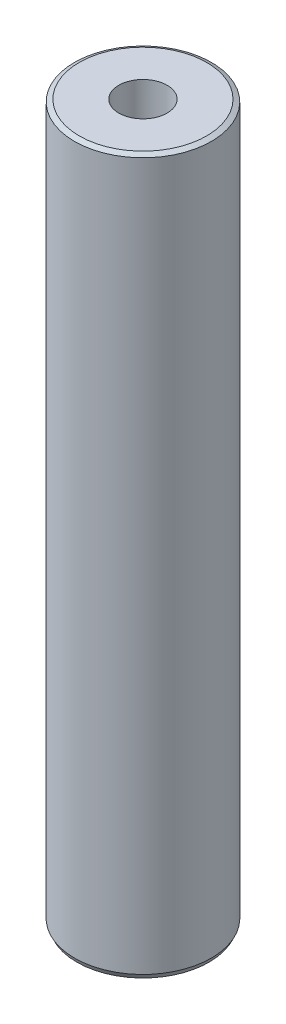
ISO-10303-21;
HEADER;
FILE_DESCRIPTION(('STEP AP214'),'2;1');
FILE_NAME('part.step','',(''),(''),'','','');
FILE_SCHEMA(('AUTOMOTIVE_DESIGN { 1 0 10303 214 1 1 1 1 }'));
ENDSEC;
DATA;
#1=APPLICATION_CONTEXT('core data for automotive mechanical design processes');
#2=APPLICATION_PROTOCOL_DEFINITION('international standard','automotive_design',2000,#1);
#3=PRODUCT_CONTEXT('',#1,'mechanical');
#4=PRODUCT('Part','Part','',(#3));
#5=PRODUCT_RELATED_PRODUCT_CATEGORY('part','',(#4));
#6=PRODUCT_DEFINITION_FORMATION('','',#4);
#7=PRODUCT_DEFINITION_CONTEXT('part definition',#1,'design');
#8=PRODUCT_DEFINITION('design','',#6,#7);
#9=PRODUCT_DEFINITION_SHAPE('','',#8);
#10=(LENGTH_UNIT() NAMED_UNIT(*) SI_UNIT(.MILLI.,.METRE.));
#11=(NAMED_UNIT(*) PLANE_ANGLE_UNIT() SI_UNIT($,.RADIAN.));
#12=(NAMED_UNIT(*) SI_UNIT($,.STERADIAN.) SOLID_ANGLE_UNIT());
#13=UNCERTAINTY_MEASURE_WITH_UNIT(LENGTH_MEASURE(1.E-05),#10,'distance_accuracy_value','');
#14=(GEOMETRIC_REPRESENTATION_CONTEXT(3) GLOBAL_UNCERTAINTY_ASSIGNED_CONTEXT((#13)) GLOBAL_UNIT_ASSIGNED_CONTEXT((#10,
#11,#12)) REPRESENTATION_CONTEXT('',''));
#15=CARTESIAN_POINT('',(0.,0.,0.));
#16=DIRECTION('',(0.,0.,1.));
#17=DIRECTION('',(1.,0.,0.));
#18=AXIS2_PLACEMENT_3D('',#15,#16,#17);
#19=CARTESIAN_POINT('',(0.,600.,0.));
#20=DIRECTION('',(0.,-1.,0.));
#21=DIRECTION('',(0.,0.,-1.));
#22=AXIS2_PLACEMENT_3D('',#19,#20,#21);
#23=CYLINDRICAL_SURFACE('',#22,57.5);
#24=CARTESIAN_POINT('',(0.,598.015468564472,0.));
#25=DIRECTION('',(0.,1.,0.));
#26=DIRECTION('',(0.,0.,1.));
#27=AXIS2_PLACEMENT_3D('',#24,#25,#26);
#28=CIRCLE('',#27,57.5);
#29=CARTESIAN_POINT('',(0.,598.015468564472,57.5));
#30=VERTEX_POINT('',#29);
#31=EDGE_CURVE('E50',#30,#30,#28,.F.);
#32=ORIENTED_EDGE('',*,*,#31,.T.);
#33=EDGE_LOOP('',(#32));
#34=FACE_BOUND('',#33,.T.);
#35=CARTESIAN_POINT('',(0.,3.99868103134027,0.));
#36=DIRECTION('',(0.,1.,0.));
#37=DIRECTION('',(0.,0.,1.));
#38=AXIS2_PLACEMENT_3D('',#35,#36,#37);
#39=CIRCLE('',#38,57.5);
#40=CARTESIAN_POINT('',(0.,3.99868103134027,57.5));
#41=VERTEX_POINT('',#40);
#42=EDGE_CURVE('E51',#41,#41,#39,.T.);
#43=ORIENTED_EDGE('',*,*,#42,.T.);
#44=EDGE_LOOP('',(#43));
#45=FACE_BOUND('',#44,.T.);
#46=ADVANCED_FACE('F39',(#34,#45),#23,.T.);
#47=CARTESIAN_POINT('',(0.,600.,0.));
#48=DIRECTION('',(0.,1.,0.));
#49=DIRECTION('',(0.,0.,1.));
#50=AXIS2_PLACEMENT_3D('',#47,#48,#49);
#51=PLANE('',#50);
#52=CARTESIAN_POINT('',(0.,600.,0.));
#53=DIRECTION('',(0.,1.,0.));
#54=DIRECTION('',(0.,0.,1.));
#55=AXIS2_PLACEMENT_3D('',#52,#53,#54);
#56=CIRCLE('',#55,53.5013189686597);
#57=CARTESIAN_POINT('',(0.,600.,53.5013189686597));
#58=VERTEX_POINT('',#57);
#59=EDGE_CURVE('E54',#58,#58,#56,.T.);
#60=ORIENTED_EDGE('',*,*,#59,.T.);
#61=EDGE_LOOP('',(#60));
#62=FACE_BOUND('',#61,.T.);
#63=CARTESIAN_POINT('',(0.,600.,0.));
#64=DIRECTION('',(0.,1.,0.));
#65=DIRECTION('',(0.,0.,1.));
#66=AXIS2_PLACEMENT_3D('',#63,#64,#65);
#67=CIRCLE('',#66,20.299832830061);
#68=CARTESIAN_POINT('',(0.,600.,20.299832830061));
#69=VERTEX_POINT('',#68);
#70=EDGE_CURVE('E58',#69,#69,#67,.T.);
#71=ORIENTED_EDGE('',*,*,#70,.F.);
#72=EDGE_LOOP('',(#71));
#73=FACE_BOUND('',#72,.T.);
#74=ADVANCED_FACE('F69',(#62,#73),#51,.T.);
#75=CARTESIAN_POINT('',(0.,0.,0.));
#76=DIRECTION('',(0.,1.,0.));
#77=DIRECTION('',(0.,0.,1.));
#78=AXIS2_PLACEMENT_3D('',#75,#76,#77);
#79=PLANE('',#78);
#80=CARTESIAN_POINT('',(0.,0.,0.));
#81=DIRECTION('',(0.,1.,0.));
#82=DIRECTION('',(0.,0.,1.));
#83=AXIS2_PLACEMENT_3D('',#80,#81,#82);
#84=CIRCLE('',#83,55.5154685644718);
#85=CARTESIAN_POINT('',(0.,0.,55.5154685644718));
#86=VERTEX_POINT('',#85);
#87=EDGE_CURVE('E10',#86,#86,#84,.F.);
#88=ORIENTED_EDGE('',*,*,#87,.T.);
#89=EDGE_LOOP('',(#88));
#90=FACE_BOUND('',#89,.T.);
#91=CARTESIAN_POINT('',(0.,0.,0.));
#92=DIRECTION('',(0.,1.,0.));
#93=DIRECTION('',(0.,0.,1.));
#94=AXIS2_PLACEMENT_3D('',#91,#92,#93);
#95=CIRCLE('',#94,20.299832830061);
#96=CARTESIAN_POINT('',(0.,0.,20.299832830061));
#97=VERTEX_POINT('',#96);
#98=EDGE_CURVE('E63',#97,#97,#95,.T.);
#99=ORIENTED_EDGE('',*,*,#98,.T.);
#100=EDGE_LOOP('',(#99));
#101=FACE_BOUND('',#100,.T.);
#102=ADVANCED_FACE('F75',(#90,#101),#79,.F.);
#103=CARTESIAN_POINT('',(0.,600.,0.));
#104=DIRECTION('',(0.,-1.,0.));
#105=DIRECTION('',(0.,0.,-1.));
#106=AXIS2_PLACEMENT_3D('',#103,#104,#105);
#107=CYLINDRICAL_SURFACE('',#106,20.299832830061);
#108=ORIENTED_EDGE('',*,*,#70,.T.);
#109=EDGE_LOOP('',(#108));
#110=FACE_BOUND('',#109,.T.);
#111=ORIENTED_EDGE('',*,*,#98,.F.);
#112=EDGE_LOOP('',(#111));
#113=FACE_BOUND('',#112,.T.);
#114=ADVANCED_FACE('F70',(#110,#113),#107,.F.);
#115=CARTESIAN_POINT('',(0.,600.,0.));
#116=DIRECTION('',(0.,-1.,0.));
#117=DIRECTION('',(0.,0.,-1.));
#118=AXIS2_PLACEMENT_3D('',#115,#116,#117);
#119=CONICAL_SURFACE('',#118,53.5013189686597,1.11011589765514);
#120=ORIENTED_EDGE('',*,*,#31,.F.);
#121=EDGE_LOOP('',(#120));
#122=FACE_BOUND('',#121,.T.);
#123=ORIENTED_EDGE('',*,*,#59,.F.);
#124=EDGE_LOOP('',(#123));
#125=FACE_BOUND('',#124,.T.);
#126=ADVANCED_FACE('F81',(#122,#125),#119,.T.);
#127=CARTESIAN_POINT('',(0.,3.99868103134027,0.));
#128=DIRECTION('',(0.,1.,0.));
#129=DIRECTION('',(0.,0.,1.));
#130=AXIS2_PLACEMENT_3D('',#127,#128,#129);
#131=CONICAL_SURFACE('',#130,57.5,0.460680429139767);
#132=ORIENTED_EDGE('',*,*,#87,.F.);
#133=EDGE_LOOP('',(#132));
#134=FACE_BOUND('',#133,.T.);
#135=ORIENTED_EDGE('',*,*,#42,.F.);
#136=EDGE_LOOP('',(#135));
#137=FACE_BOUND('',#136,.T.);
#138=ADVANCED_FACE('F45',(#134,#137),#131,.T.);
#139=CLOSED_SHELL('',(#46,#74,#102,#114,#126,#138));
#140=MANIFOLD_SOLID_BREP('B2',#139);
#141=ADVANCED_BREP_SHAPE_REPRESENTATION('',(#18,#140),#14);
#142=SHAPE_DEFINITION_REPRESENTATION(#9,#141);
ENDSEC;
END-ISO-10303-21;
